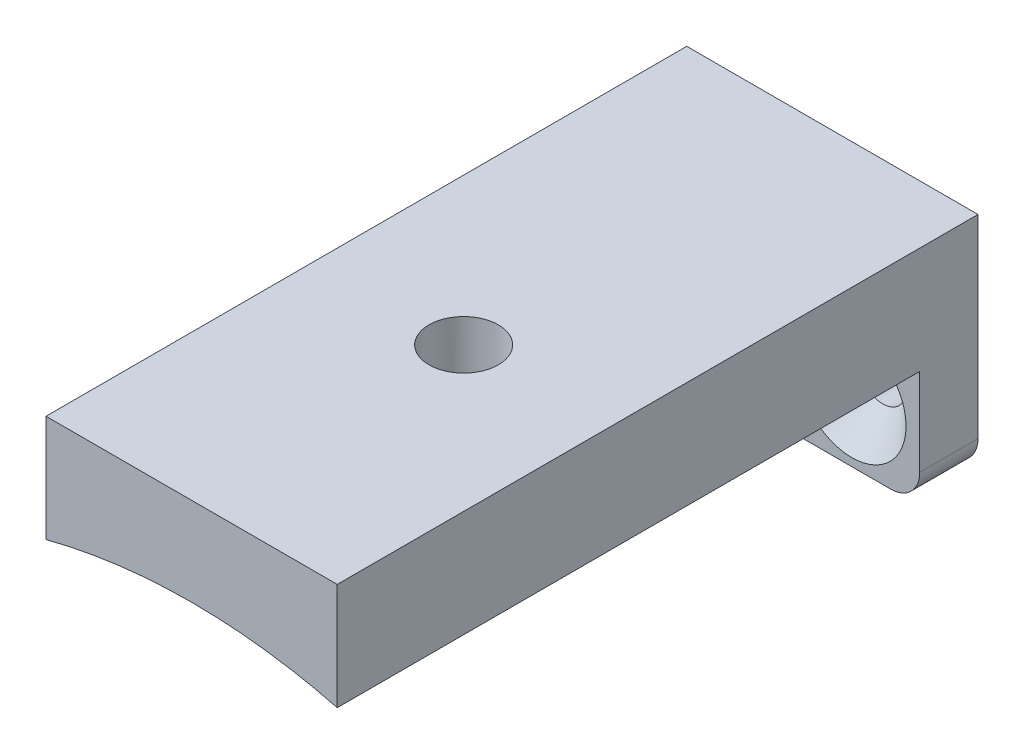
ISO-10303-21;
HEADER;
FILE_DESCRIPTION(('STEP AP214'),'2;1');
FILE_NAME('part.step','',(''),(''),'','','');
FILE_SCHEMA(('AUTOMOTIVE_DESIGN { 1 0 10303 214 1 1 1 1 }'));
ENDSEC;
DATA;
#1=APPLICATION_CONTEXT('core data for automotive mechanical design processes');
#2=APPLICATION_PROTOCOL_DEFINITION('international standard','automotive_design',2000,#1);
#3=PRODUCT_CONTEXT('',#1,'mechanical');
#4=PRODUCT('Part','Part','',(#3));
#5=PRODUCT_RELATED_PRODUCT_CATEGORY('part','',(#4));
#6=PRODUCT_DEFINITION_FORMATION('','',#4);
#7=PRODUCT_DEFINITION_CONTEXT('part definition',#1,'design');
#8=PRODUCT_DEFINITION('design','',#6,#7);
#9=PRODUCT_DEFINITION_SHAPE('','',#8);
#10=(LENGTH_UNIT() NAMED_UNIT(*) SI_UNIT(.MILLI.,.METRE.));
#11=(NAMED_UNIT(*) PLANE_ANGLE_UNIT() SI_UNIT($,.RADIAN.));
#12=(NAMED_UNIT(*) SI_UNIT($,.STERADIAN.) SOLID_ANGLE_UNIT());
#13=UNCERTAINTY_MEASURE_WITH_UNIT(LENGTH_MEASURE(1.E-05),#10,'distance_accuracy_value','');
#14=(GEOMETRIC_REPRESENTATION_CONTEXT(3) GLOBAL_UNCERTAINTY_ASSIGNED_CONTEXT((#13)) GLOBAL_UNIT_ASSIGNED_CONTEXT((#10,
#11,#12)) REPRESENTATION_CONTEXT('',''));
#15=CARTESIAN_POINT('',(0.,0.,0.));
#16=DIRECTION('',(0.,0.,1.));
#17=DIRECTION('',(1.,0.,0.));
#18=AXIS2_PLACEMENT_3D('',#15,#16,#17);
#19=CARTESIAN_POINT('',(-15.,12.,6.));
#20=DIRECTION('',(1.,0.,0.));
#21=DIRECTION('',(0.,0.,-1.));
#22=AXIS2_PLACEMENT_3D('',#19,#20,#21);
#23=PLANE('',#22);
#24=DIRECTION('',(0.,-1.,0.));
#25=VECTOR('',#24,1.);
#26=CARTESIAN_POINT('',(-15.,12.,0.));
#27=LINE('',#26,#25);
#28=CARTESIAN_POINT('',(-15.,23.,0.));
#29=VERTEX_POINT('',#28);
#30=CARTESIAN_POINT('',(-15.,3.00000000000002,0.));
#31=VERTEX_POINT('',#30);
#32=EDGE_CURVE('E127',#29,#31,#27,.T.);
#33=ORIENTED_EDGE('',*,*,#32,.T.);
#34=DIRECTION('',(0.,0.,-1.));
#35=VECTOR('',#34,1.);
#36=CARTESIAN_POINT('',(-15.,3.00000000000002,6.));
#37=LINE('',#36,#35);
#38=CARTESIAN_POINT('',(-15.,3.00000000000002,6.));
#39=VERTEX_POINT('',#38);
#40=EDGE_CURVE('E11',#39,#31,#37,.T.);
#41=ORIENTED_EDGE('',*,*,#40,.F.);
#42=DIRECTION('',(0.,-1.,0.));
#43=VECTOR('',#42,1.);
#44=CARTESIAN_POINT('',(-15.,12.,6.));
#45=LINE('',#44,#43);
#46=CARTESIAN_POINT('',(-15.,12.,6.));
#47=VERTEX_POINT('',#46);
#48=EDGE_CURVE('E97',#47,#39,#45,.T.);
#49=ORIENTED_EDGE('',*,*,#48,.F.);
#50=DIRECTION('',(0.,0.,1.));
#51=VECTOR('',#50,1.);
#52=CARTESIAN_POINT('',(-15.,12.,0.));
#53=LINE('',#52,#51);
#54=CARTESIAN_POINT('',(-15.,12.,66.));
#55=VERTEX_POINT('',#54);
#56=EDGE_CURVE('E176',#47,#55,#53,.T.);
#57=ORIENTED_EDGE('',*,*,#56,.T.);
#58=DIRECTION('',(0.,1.,0.));
#59=VECTOR('',#58,1.);
#60=CARTESIAN_POINT('',(-15.,12.,66.));
#61=LINE('',#60,#59);
#62=CARTESIAN_POINT('',(-15.,23.,66.));
#63=VERTEX_POINT('',#62);
#64=EDGE_CURVE('E178',#55,#63,#61,.T.);
#65=ORIENTED_EDGE('',*,*,#64,.T.);
#66=DIRECTION('',(0.,0.,1.));
#67=VECTOR('',#66,1.);
#68=CARTESIAN_POINT('',(-15.,23.,0.));
#69=LINE('',#68,#67);
#70=EDGE_CURVE('E183',#29,#63,#69,.T.);
#71=ORIENTED_EDGE('',*,*,#70,.F.);
#72=EDGE_LOOP('',(#33,#41,#49,#57,#65,#71));
#73=FACE_BOUND('',#72,.T.);
#74=ADVANCED_FACE('F45',(#73),#23,.F.);
#75=CARTESIAN_POINT('',(-12.,3.,6.));
#76=DIRECTION('',(0.,0.,-1.));
#77=DIRECTION('',(-1.,0.,0.));
#78=AXIS2_PLACEMENT_3D('',#75,#76,#77);
#79=CYLINDRICAL_SURFACE('',#78,3.);
#80=CARTESIAN_POINT('',(-12.,3.,0.));
#81=DIRECTION('',(0.,0.,1.));
#82=DIRECTION('',(1.,0.,0.));
#83=AXIS2_PLACEMENT_3D('',#80,#81,#82);
#84=CIRCLE('',#83,3.);
#85=CARTESIAN_POINT('',(-12.,0.,0.));
#86=VERTEX_POINT('',#85);
#87=EDGE_CURVE('E130',#31,#86,#84,.T.);
#88=ORIENTED_EDGE('',*,*,#87,.T.);
#89=DIRECTION('',(0.,0.,-1.));
#90=VECTOR('',#89,1.);
#91=CARTESIAN_POINT('',(-12.,0.,6.));
#92=LINE('',#91,#90);
#93=CARTESIAN_POINT('',(-12.,0.,6.));
#94=VERTEX_POINT('',#93);
#95=EDGE_CURVE('E55',#94,#86,#92,.T.);
#96=ORIENTED_EDGE('',*,*,#95,.F.);
#97=CARTESIAN_POINT('',(-12.,3.,6.));
#98=DIRECTION('',(0.,0.,1.));
#99=DIRECTION('',(1.,0.,0.));
#100=AXIS2_PLACEMENT_3D('',#97,#98,#99);
#101=CIRCLE('',#100,3.);
#102=EDGE_CURVE('E111',#39,#94,#101,.T.);
#103=ORIENTED_EDGE('',*,*,#102,.F.);
#104=ORIENTED_EDGE('',*,*,#40,.T.);
#105=EDGE_LOOP('',(#88,#96,#103,#104));
#106=FACE_BOUND('',#105,.T.);
#107=ADVANCED_FACE('F249',(#106),#79,.T.);
#108=CARTESIAN_POINT('',(-12.,0.,6.));
#109=DIRECTION('',(0.,1.,0.));
#110=DIRECTION('',(0.,0.,1.));
#111=AXIS2_PLACEMENT_3D('',#108,#109,#110);
#112=PLANE('',#111);
#113=DIRECTION('',(1.,0.,0.));
#114=VECTOR('',#113,1.);
#115=CARTESIAN_POINT('',(-12.,0.,0.));
#116=LINE('',#115,#114);
#117=CARTESIAN_POINT('',(12.,0.,0.));
#118=VERTEX_POINT('',#117);
#119=EDGE_CURVE('E81',#86,#118,#116,.T.);
#120=ORIENTED_EDGE('',*,*,#119,.T.);
#121=DIRECTION('',(0.,0.,-1.));
#122=VECTOR('',#121,1.);
#123=CARTESIAN_POINT('',(12.,0.,6.));
#124=LINE('',#123,#122);
#125=CARTESIAN_POINT('',(12.,0.,6.));
#126=VERTEX_POINT('',#125);
#127=EDGE_CURVE('E115',#126,#118,#124,.T.);
#128=ORIENTED_EDGE('',*,*,#127,.F.);
#129=DIRECTION('',(1.,0.,0.));
#130=VECTOR('',#129,1.);
#131=CARTESIAN_POINT('',(-12.,0.,6.));
#132=LINE('',#131,#130);
#133=EDGE_CURVE('E106',#94,#126,#132,.T.);
#134=ORIENTED_EDGE('',*,*,#133,.F.);
#135=ORIENTED_EDGE('',*,*,#95,.T.);
#136=EDGE_LOOP('',(#120,#128,#134,#135));
#137=FACE_BOUND('',#136,.T.);
#138=ADVANCED_FACE('F116',(#137),#112,.F.);
#139=CARTESIAN_POINT('',(12.,3.,6.));
#140=DIRECTION('',(0.,0.,-1.));
#141=DIRECTION('',(-1.,0.,0.));
#142=AXIS2_PLACEMENT_3D('',#139,#140,#141);
#143=CYLINDRICAL_SURFACE('',#142,3.);
#144=CARTESIAN_POINT('',(12.,3.,0.));
#145=DIRECTION('',(0.,0.,1.));
#146=DIRECTION('',(1.,0.,0.));
#147=AXIS2_PLACEMENT_3D('',#144,#145,#146);
#148=CIRCLE('',#147,3.);
#149=CARTESIAN_POINT('',(15.,3.,0.));
#150=VERTEX_POINT('',#149);
#151=EDGE_CURVE('E88',#118,#150,#148,.T.);
#152=ORIENTED_EDGE('',*,*,#151,.T.);
#153=DIRECTION('',(0.,0.,-1.));
#154=VECTOR('',#153,1.);
#155=CARTESIAN_POINT('',(15.,3.,6.));
#156=LINE('',#155,#154);
#157=CARTESIAN_POINT('',(15.,3.,6.));
#158=VERTEX_POINT('',#157);
#159=EDGE_CURVE('E118',#158,#150,#156,.T.);
#160=ORIENTED_EDGE('',*,*,#159,.F.);
#161=CARTESIAN_POINT('',(12.,3.,6.));
#162=DIRECTION('',(0.,0.,1.));
#163=DIRECTION('',(1.,0.,0.));
#164=AXIS2_PLACEMENT_3D('',#161,#162,#163);
#165=CIRCLE('',#164,3.);
#166=EDGE_CURVE('E109',#126,#158,#165,.T.);
#167=ORIENTED_EDGE('',*,*,#166,.F.);
#168=ORIENTED_EDGE('',*,*,#127,.T.);
#169=EDGE_LOOP('',(#152,#160,#167,#168));
#170=FACE_BOUND('',#169,.T.);
#171=ADVANCED_FACE('F120',(#170),#143,.T.);
#172=CARTESIAN_POINT('',(15.,3.00000000000002,6.));
#173=DIRECTION('',(-1.,0.,0.));
#174=DIRECTION('',(0.,0.,1.));
#175=AXIS2_PLACEMENT_3D('',#172,#173,#174);
#176=PLANE('',#175);
#177=DIRECTION('',(0.,1.,0.));
#178=VECTOR('',#177,1.);
#179=CARTESIAN_POINT('',(15.,3.00000000000002,0.));
#180=LINE('',#179,#178);
#181=CARTESIAN_POINT('',(15.,23.,0.));
#182=VERTEX_POINT('',#181);
#183=EDGE_CURVE('E138',#150,#182,#180,.T.);
#184=ORIENTED_EDGE('',*,*,#183,.T.);
#185=DIRECTION('',(0.,0.,1.));
#186=VECTOR('',#185,1.);
#187=CARTESIAN_POINT('',(15.,23.,0.));
#188=LINE('',#187,#186);
#189=CARTESIAN_POINT('',(15.,23.,66.));
#190=VERTEX_POINT('',#189);
#191=EDGE_CURVE('E161',#182,#190,#188,.T.);
#192=ORIENTED_EDGE('',*,*,#191,.T.);
#193=DIRECTION('',(0.,-1.,0.));
#194=VECTOR('',#193,1.);
#195=CARTESIAN_POINT('',(15.,23.,66.));
#196=LINE('',#195,#194);
#197=CARTESIAN_POINT('',(15.,12.,66.));
#198=VERTEX_POINT('',#197);
#199=EDGE_CURVE('E212',#190,#198,#196,.T.);
#200=ORIENTED_EDGE('',*,*,#199,.T.);
#201=DIRECTION('',(0.,0.,1.));
#202=VECTOR('',#201,1.);
#203=CARTESIAN_POINT('',(15.,12.,0.));
#204=LINE('',#203,#202);
#205=CARTESIAN_POINT('',(15.,12.,6.));
#206=VERTEX_POINT('',#205);
#207=EDGE_CURVE('E196',#206,#198,#204,.T.);
#208=ORIENTED_EDGE('',*,*,#207,.F.);
#209=DIRECTION('',(0.,1.,0.));
#210=VECTOR('',#209,1.);
#211=CARTESIAN_POINT('',(15.,3.00000000000002,6.));
#212=LINE('',#211,#210);
#213=EDGE_CURVE('E63',#158,#206,#212,.T.);
#214=ORIENTED_EDGE('',*,*,#213,.F.);
#215=ORIENTED_EDGE('',*,*,#159,.T.);
#216=EDGE_LOOP('',(#184,#192,#200,#208,#214,#215));
#217=FACE_BOUND('',#216,.T.);
#218=ADVANCED_FACE('F158',(#217),#176,.F.);
#219=CARTESIAN_POINT('',(0.,-46.0947501931112,6.));
#220=DIRECTION('',(0.,0.,-1.));
#221=DIRECTION('',(-1.,0.,0.));
#222=AXIS2_PLACEMENT_3D('',#219,#220,#221);
#223=PLANE('',#222);
#224=CARTESIAN_POINT('',(-8.,6.4,6.));
#225=DIRECTION('',(0.,0.,1.));
#226=DIRECTION('',(1.,0.,0.));
#227=AXIS2_PLACEMENT_3D('',#224,#225,#226);
#228=CIRCLE('',#227,5.59);
#229=CARTESIAN_POINT('',(-2.41,6.4,6.));
#230=VERTEX_POINT('',#229);
#231=EDGE_CURVE('E182',#230,#230,#228,.T.);
#232=ORIENTED_EDGE('',*,*,#231,.F.);
#233=EDGE_LOOP('',(#232));
#234=FACE_BOUND('',#233,.T.);
#235=CARTESIAN_POINT('',(8.,6.4,6.));
#236=DIRECTION('',(0.,0.,1.));
#237=DIRECTION('',(1.,0.,0.));
#238=AXIS2_PLACEMENT_3D('',#235,#236,#237);
#239=CIRCLE('',#238,5.59);
#240=CARTESIAN_POINT('',(13.59,6.4,6.));
#241=VERTEX_POINT('',#240);
#242=EDGE_CURVE('E234',#241,#241,#239,.T.);
#243=ORIENTED_EDGE('',*,*,#242,.F.);
#244=EDGE_LOOP('',(#243));
#245=FACE_BOUND('',#244,.T.);
#246=CARTESIAN_POINT('',(0.,-46.0947501931112,6.));
#247=DIRECTION('',(0.,0.,1.));
#248=DIRECTION('',(-1.,0.,0.));
#249=AXIS2_PLACEMENT_3D('',#246,#247,#248);
#250=CIRCLE('',#249,60.);
#251=EDGE_CURVE('E142',#206,#47,#250,.T.);
#252=ORIENTED_EDGE('',*,*,#251,.T.);
#253=ORIENTED_EDGE('',*,*,#48,.T.);
#254=ORIENTED_EDGE('',*,*,#102,.T.);
#255=ORIENTED_EDGE('',*,*,#133,.T.);
#256=ORIENTED_EDGE('',*,*,#166,.T.);
#257=ORIENTED_EDGE('',*,*,#213,.T.);
#258=EDGE_LOOP('',(#252,#253,#254,#255,#256,#257));
#259=FACE_BOUND('',#258,.T.);
#260=ADVANCED_FACE('F107',(#234,#245,#259),#223,.F.);
#261=CARTESIAN_POINT('',(0.,-46.0947501931112,0.));
#262=DIRECTION('',(0.,0.,-1.));
#263=DIRECTION('',(-1.,0.,0.));
#264=AXIS2_PLACEMENT_3D('',#261,#262,#263);
#265=PLANE('',#264);
#266=CARTESIAN_POINT('',(-8.,6.4,0.));
#267=DIRECTION('',(0.,0.,1.));
#268=DIRECTION('',(1.,0.,0.));
#269=AXIS2_PLACEMENT_3D('',#266,#267,#268);
#270=CIRCLE('',#269,2.4);
#271=CARTESIAN_POINT('',(-5.6,6.4,0.));
#272=VERTEX_POINT('',#271);
#273=EDGE_CURVE('E230',#272,#272,#270,.T.);
#274=ORIENTED_EDGE('',*,*,#273,.T.);
#275=EDGE_LOOP('',(#274));
#276=FACE_BOUND('',#275,.T.);
#277=CARTESIAN_POINT('',(8.,6.4,0.));
#278=DIRECTION('',(0.,0.,1.));
#279=DIRECTION('',(1.,0.,0.));
#280=AXIS2_PLACEMENT_3D('',#277,#278,#279);
#281=CIRCLE('',#280,2.4);
#282=CARTESIAN_POINT('',(10.4,6.4,0.));
#283=VERTEX_POINT('',#282);
#284=EDGE_CURVE('E131',#283,#283,#281,.T.);
#285=ORIENTED_EDGE('',*,*,#284,.T.);
#286=EDGE_LOOP('',(#285));
#287=FACE_BOUND('',#286,.T.);
#288=ORIENTED_EDGE('',*,*,#32,.F.);
#289=DIRECTION('',(1.,0.,0.));
#290=VECTOR('',#289,1.);
#291=CARTESIAN_POINT('',(-15.,23.,0.));
#292=LINE('',#291,#290);
#293=EDGE_CURVE('E154',#29,#182,#292,.T.);
#294=ORIENTED_EDGE('',*,*,#293,.T.);
#295=ORIENTED_EDGE('',*,*,#183,.F.);
#296=ORIENTED_EDGE('',*,*,#151,.F.);
#297=ORIENTED_EDGE('',*,*,#119,.F.);
#298=ORIENTED_EDGE('',*,*,#87,.F.);
#299=EDGE_LOOP('',(#288,#294,#295,#296,#297,#298));
#300=FACE_BOUND('',#299,.T.);
#301=ADVANCED_FACE('F150',(#276,#287,#300),#265,.T.);
#302=CARTESIAN_POINT('',(8.,6.4,6.));
#303=DIRECTION('',(0.,0.,1.));
#304=DIRECTION('',(1.,0.,0.));
#305=AXIS2_PLACEMENT_3D('',#302,#303,#304);
#306=CYLINDRICAL_SURFACE('',#305,2.4);
#307=ORIENTED_EDGE('',*,*,#284,.F.);
#308=EDGE_LOOP('',(#307));
#309=FACE_BOUND('',#308,.T.);
#310=CARTESIAN_POINT('',(8.,6.4,2.81));
#311=DIRECTION('',(0.,0.,1.));
#312=DIRECTION('',(1.,0.,0.));
#313=AXIS2_PLACEMENT_3D('',#310,#311,#312);
#314=CIRCLE('',#313,2.4);
#315=CARTESIAN_POINT('',(10.4,6.4,2.81));
#316=VERTEX_POINT('',#315);
#317=EDGE_CURVE('E238',#316,#316,#314,.T.);
#318=ORIENTED_EDGE('',*,*,#317,.T.);
#319=EDGE_LOOP('',(#318));
#320=FACE_BOUND('',#319,.T.);
#321=ADVANCED_FACE('F263',(#309,#320),#306,.F.);
#322=CARTESIAN_POINT('',(8.,6.4,6.));
#323=DIRECTION('',(0.,0.,1.));
#324=DIRECTION('',(1.,0.,0.));
#325=AXIS2_PLACEMENT_3D('',#322,#323,#324);
#326=CONICAL_SURFACE('',#325,5.59,0.785398163397449);
#327=ORIENTED_EDGE('',*,*,#317,.F.);
#328=EDGE_LOOP('',(#327));
#329=FACE_BOUND('',#328,.T.);
#330=ORIENTED_EDGE('',*,*,#242,.T.);
#331=EDGE_LOOP('',(#330));
#332=FACE_BOUND('',#331,.T.);
#333=ADVANCED_FACE('F270',(#329,#332),#326,.F.);
#334=CARTESIAN_POINT('',(-8.,6.4,6.));
#335=DIRECTION('',(0.,0.,1.));
#336=DIRECTION('',(1.,0.,0.));
#337=AXIS2_PLACEMENT_3D('',#334,#335,#336);
#338=CYLINDRICAL_SURFACE('',#337,2.4);
#339=ORIENTED_EDGE('',*,*,#273,.F.);
#340=EDGE_LOOP('',(#339));
#341=FACE_BOUND('',#340,.T.);
#342=CARTESIAN_POINT('',(-8.,6.4,2.81));
#343=DIRECTION('',(0.,0.,1.));
#344=DIRECTION('',(1.,0.,0.));
#345=AXIS2_PLACEMENT_3D('',#342,#343,#344);
#346=CIRCLE('',#345,2.4);
#347=CARTESIAN_POINT('',(-5.6,6.4,2.81));
#348=VERTEX_POINT('',#347);
#349=EDGE_CURVE('E226',#348,#348,#346,.T.);
#350=ORIENTED_EDGE('',*,*,#349,.T.);
#351=EDGE_LOOP('',(#350));
#352=FACE_BOUND('',#351,.T.);
#353=ADVANCED_FACE('F274',(#341,#352),#338,.F.);
#354=CARTESIAN_POINT('',(-8.,6.4,6.));
#355=DIRECTION('',(0.,0.,1.));
#356=DIRECTION('',(1.,0.,0.));
#357=AXIS2_PLACEMENT_3D('',#354,#355,#356);
#358=CONICAL_SURFACE('',#357,5.59,0.785398163397449);
#359=ORIENTED_EDGE('',*,*,#349,.F.);
#360=EDGE_LOOP('',(#359));
#361=FACE_BOUND('',#360,.T.);
#362=ORIENTED_EDGE('',*,*,#231,.T.);
#363=EDGE_LOOP('',(#362));
#364=FACE_BOUND('',#363,.T.);
#365=ADVANCED_FACE('F278',(#361,#364),#358,.F.);
#366=CARTESIAN_POINT('',(0.,-46.0947501931112,0.));
#367=DIRECTION('',(0.,0.,1.));
#368=DIRECTION('',(1.,0.,0.));
#369=AXIS2_PLACEMENT_3D('',#366,#367,#368);
#370=CYLINDRICAL_SURFACE('',#369,60.);
#371=CARTESIAN_POINT('',(0.121475485369321,13.9051268376499,44.0730291017226));
#372=CARTESIAN_POINT('',(0.288306900275761,13.9047895121054,44.073030735129));
#373=CARTESIAN_POINT('',(0.455111942733274,13.903754130058,44.0660142029317));
#374=CARTESIAN_POINT('',(0.78758314014404,13.9003107650474,44.0380001098651));
#375=CARTESIAN_POINT('',(0.95324901188909,13.8979024524189,44.0169991908888));
#376=CARTESIAN_POINT('',(1.28233626942047,13.8917710146109,43.961142553556));
#377=CARTESIAN_POINT('',(1.445755754375,13.8880468395318,43.9262757691138));
#378=CARTESIAN_POINT('',(1.76911659791562,13.8793808599646,43.8429274928021));
#379=CARTESIAN_POINT('',(1.92905666051269,13.8744386099502,43.7944410184514));
#380=CARTESIAN_POINT('',(2.24410841660304,13.8634752728599,43.684264520182));
#381=CARTESIAN_POINT('',(2.39922466093211,13.8574552411962,43.6225874017401));
#382=CARTESIAN_POINT('',(2.70375602483526,13.8444935594458,43.4864203936285));
#383=CARTESIAN_POINT('',(2.8531690203965,13.8375515702314,43.411925786251));
#384=CARTESIAN_POINT('',(3.14510134532214,13.8229407537132,43.250717981695));
#385=CARTESIAN_POINT('',(3.28762457674367,13.8152723452809,43.1640118121364));
#386=CARTESIAN_POINT('',(3.56492524551969,13.7994115065266,42.9789284617578));
#387=CARTESIAN_POINT('',(3.69969979386538,13.7912188831318,42.8805469692805));
#388=CARTESIAN_POINT('',(3.96086975898068,13.7745130767939,42.6725415912132));
#389=CARTESIAN_POINT('',(4.08724079739188,13.7659990647226,42.562887161983));
#390=CARTESIAN_POINT('',(4.33035071168885,13.7489037813208,42.3332940177267));
#391=CARTESIAN_POINT('',(4.44708600997719,13.7403224862925,42.2133515163062));
#392=CARTESIAN_POINT('',(4.67001633119433,13.723336070395,41.9640995921718));
#393=CARTESIAN_POINT('',(4.77621473664646,13.7149308936767,41.8347931986366));
#394=CARTESIAN_POINT('',(4.97740255890584,13.6985241587444,41.5676369552356));
#395=CARTESIAN_POINT('',(5.0723878250426,13.6905227506134,41.4297839703709));
#396=CARTESIAN_POINT('',(5.25058380693164,13.6751367548445,41.1462999188646));
#397=CARTESIAN_POINT('',(5.33377393087703,13.6677532549283,41.0006558463972));
#398=CARTESIAN_POINT('',(5.48761665469883,13.6538232755866,40.7027861632779));
#399=CARTESIAN_POINT('',(5.55826459941638,13.6472771071962,40.550558134885));
#400=CARTESIAN_POINT('',(5.68644976219548,13.6352125253937,40.2406956303324));
#401=CARTESIAN_POINT('',(5.74399206797766,13.6296937133056,40.0830632796131));
#402=CARTESIAN_POINT('',(5.84559890608043,13.6198337809266,39.7634601457816));
#403=CARTESIAN_POINT('',(5.88965847570412,13.615493094344,39.6014877890089));
#404=CARTESIAN_POINT('',(6.00077585282751,13.6044670495213,39.1119875951088));
#405=CARTESIAN_POINT('',(6.04734051731879,13.5997224217353,38.7794988892712));
#406=CARTESIAN_POINT('',(6.08401762482422,13.5959946598984,38.111574783169));
#407=CARTESIAN_POINT('',(6.07413153027151,13.597011376592,37.7761394594653));
#408=CARTESIAN_POINT('',(5.99841232971398,13.6046674964159,37.1128848220421));
#409=CARTESIAN_POINT('',(5.93277905273735,13.6112868163917,36.7850425968479));
#410=CARTESIAN_POINT('',(5.74771867669055,13.6293847513679,36.1450650512391));
#411=CARTESIAN_POINT('',(5.62829086098091,13.6408634311036,35.8329299401331));
#412=CARTESIAN_POINT('',(5.33881408113581,13.667429504918,35.2325793901981));
#413=CARTESIAN_POINT('',(5.16867638144221,13.6825232156503,34.9444070229803));
#414=CARTESIAN_POINT('',(4.7826692658537,13.7146425440546,34.4006377190223));
#415=CARTESIAN_POINT('',(4.56679853213248,13.7316682173908,34.1450417213308));
#416=CARTESIAN_POINT('',(4.09433398788524,13.7658598638235,33.6725176612298));
#417=CARTESIAN_POINT('',(3.83756750894408,13.7830261251328,33.4557622280867));
#418=CARTESIAN_POINT('',(3.29119677064051,13.8155393378607,33.0684103485316));
#419=CARTESIAN_POINT('',(3.00159247531407,13.8308862872867,32.8978139526737));
#420=CARTESIAN_POINT('',(2.3976451929862,13.858086091901,32.6076297869871));
#421=CARTESIAN_POINT('',(2.0832979959062,13.8699383508219,32.4880507202295));
#422=CARTESIAN_POINT('',(1.4388422900319,13.8888606582581,32.3034218838545));
#423=CARTESIAN_POINT('',(1.10873424561877,13.8959308475805,32.2383705086676));
#424=CARTESIAN_POINT('',(0.443621326518974,13.9045274892035,32.164862492759));
#425=CARTESIAN_POINT('',(0.108643071619438,13.9060772647238,32.1561676231482));
#426=CARTESIAN_POINT('',(-0.558014254120361,13.9035809525234,32.1949938208709));
#427=CARTESIAN_POINT('',(-0.88969336877718,13.8995349392217,32.242514140591));
#428=CARTESIAN_POINT('',(-1.53964925192805,13.8863717153279,32.3922241391667));
#429=CARTESIAN_POINT('',(-1.85795192912682,13.8772648449609,32.4943023304454));
#430=CARTESIAN_POINT('',(-2.47292368773804,13.855057288402,32.7501159931826));
#431=CARTESIAN_POINT('',(-2.76959229100519,13.8419565139719,32.9038526059486));
#432=CARTESIAN_POINT('',(-3.33394985887827,13.8132208074907,33.2592099760361));
#433=CARTESIAN_POINT('',(-3.601539801533,13.7975776428539,33.4609873168319));
#434=CARTESIAN_POINT('',(-4.09913885745972,13.7655818506107,33.9064750174895));
#435=CARTESIAN_POINT('',(-4.32914704192761,13.7492292054826,34.1501864134135));
#436=CARTESIAN_POINT('',(-4.74587787241966,13.7176280507178,34.6736588649459));
#437=CARTESIAN_POINT('',(-4.93244420616707,13.7023836600534,34.9535446344039));
#438=CARTESIAN_POINT('',(-5.25591651205526,13.6748224651928,35.540822140685));
#439=CARTESIAN_POINT('',(-5.39282315426147,13.6625056214956,35.8482135063013));
#440=CARTESIAN_POINT('',(-5.61283202082788,13.6422430337841,36.4811771494112));
#441=CARTESIAN_POINT('',(-5.69602738818616,13.6342897263944,36.8067168839094));
#442=CARTESIAN_POINT('',(-5.80652938714439,13.6236509978222,37.4674098637868));
#443=CARTESIAN_POINT('',(-5.83383759482981,13.6209654280832,37.8025628377908));
#444=CARTESIAN_POINT('',(-5.83234970876361,13.6211063407956,38.3040948625691));
#445=CARTESIAN_POINT('',(-5.82482573066805,13.6218435746574,38.4707996576594));
#446=CARTESIAN_POINT('',(-5.7958230961838,13.6246661902143,38.8029626985622));
#447=CARTESIAN_POINT('',(-5.7743496193057,13.6267510715205,38.9684213840027));
#448=CARTESIAN_POINT('',(-5.71758819578345,13.6322117613987,39.2969805141792));
#449=CARTESIAN_POINT('',(-5.68229518521016,13.6355880431716,39.4600800717105));
#450=CARTESIAN_POINT('',(-5.59817072309587,13.6435312533253,39.7826588632557));
#451=CARTESIAN_POINT('',(-5.5493442230399,13.6480977462082,39.9421393983143));
#452=CARTESIAN_POINT('',(-5.43848720166895,13.6582911716817,40.2564478898789));
#453=CARTESIAN_POINT('',(-5.37645368518511,13.6639183447866,40.4112747818983));
#454=CARTESIAN_POINT('',(-5.23966020278743,13.6760676977511,40.7150955764722));
#455=CARTESIAN_POINT('',(-5.16490488754807,13.6825895503768,40.8640915862123));
#456=CARTESIAN_POINT('',(-5.00315578173447,13.6963446203389,41.1553198569116));
#457=CARTESIAN_POINT('',(-4.91615766967923,13.7035780885899,41.2975497057179));
#458=CARTESIAN_POINT('',(-4.73059218542496,13.7185439422384,41.5741471115805));
#459=CARTESIAN_POINT('',(-4.63202901987048,13.726276145769,41.708517500932));
#460=CARTESIAN_POINT('',(-4.42352627510007,13.7420561346928,41.9691094942609));
#461=CARTESIAN_POINT('',(-4.31353699277114,13.7501051954613,42.0952912565109));
#462=CARTESIAN_POINT('',(-4.08337352535885,13.766250138732,42.3379045639209));
#463=CARTESIAN_POINT('',(-3.96320307221024,13.774346003073,42.4543396509039));
#464=CARTESIAN_POINT('',(-3.71340995720571,13.7903585991069,42.6767611550437));
#465=CARTESIAN_POINT('',(-3.58378158894013,13.7982752188154,42.7827411719413));
#466=CARTESIAN_POINT('',(-3.31609718547567,13.8136921359907,42.983386427729));
#467=CARTESIAN_POINT('',(-3.17804427975999,13.8211925860998,43.0780558300099));
#468=CARTESIAN_POINT('',(-2.8940303193793,13.8355831909426,43.2557076172884));
#469=CARTESIAN_POINT('',(-2.74804776544073,13.8424715378544,43.3386557838434));
#470=CARTESIAN_POINT('',(-2.44962760119642,13.8554092750635,43.4919178457679));
#471=CARTESIAN_POINT('',(-2.29719238000882,13.8614589723872,43.5622363676054));
#472=CARTESIAN_POINT('',(-1.98702296650567,13.8725391687795,43.6897154555534));
#473=CARTESIAN_POINT('',(-1.82929324226848,13.8775705032372,43.7468868119069));
#474=CARTESIAN_POINT('',(-1.50959569529715,13.8864693694979,43.847714893474));
#475=CARTESIAN_POINT('',(-1.34762892528857,13.8903371874556,43.8913749417275));
#476=CARTESIAN_POINT('',(-0.970091185484359,13.8977881984495,43.9762178879562));
#477=CARTESIAN_POINT('',(-0.753388776122357,13.9009160113465,44.0124872582019));
#478=CARTESIAN_POINT('',(-0.317283877795166,13.9048070909938,44.0608917424323));
#479=CARTESIAN_POINT('',(-0.0978813997567413,13.9055703673097,44.0730269540519));
#480=CARTESIAN_POINT('',(0.121475485369321,13.9051268376499,44.0730291017226));
#481=B_SPLINE_CURVE_WITH_KNOTS('',3,(#371,#372,#373,#374,#375,#376,#377,#378,#379,#380,#381,
#382,#383,#384,#385,#386,#387,#388,#389,#390,#391,#392,#393,#394,#395,#396,#397,#398,#399,#400,
#401,#402,#403,#404,#405,#406,#407,#408,#409,#410,#411,#412,#413,#414,#415,#416,#417,#418,#419,
#420,#421,#422,#423,#424,#425,#426,#427,#428,#429,#430,#431,#432,#433,#434,#435,#436,#437,#438,
#439,#440,#441,#442,#443,#444,#445,#446,#447,#448,#449,#450,#451,#452,#453,#454,#455,#456,#457,
#458,#459,#460,#461,#462,#463,#464,#465,#466,#467,#468,#469,#470,#471,#472,#473,#474,#475,#476,
#477,#478,#479,#480),.UNSPECIFIED.,.T.,.F.,(4,2,2,2,2,2,2,2,2,2,2,2,2,2,2,2,2,2,2,2,2,2,2,2,2,2,
2,2,2,2,2,2,2,2,2,2,2,2,2,2,2,2,2,2,2,2,2,2,2,2,2,2,2,2,4),(0.,0.500303447203701,
1.00072707691335,1.50155088936283,2.00255815697431,2.50307747283588,3.00378140949468,
3.50419836511004,4.00480070149035,4.50679705829758,5.00897896778959,5.51099914311922,
6.01320456805569,6.51627621713455,7.01953419782648,7.5225964752103,8.02584369658281,
9.02792100747607,10.0299723583215,11.0284468831348,12.0269347098082,13.0271801192354,
14.0274543552887,15.0320696866883,16.0366861183549,17.0414738595682,18.046232013736,
19.046740092545,20.0472348656117,21.0456929271862,22.0441730494894,23.0459532688662,
24.0477582427235,25.0531140470071,26.0584562853741,27.0620504006604,28.0656162129893,
28.5657580007566,29.0657141897286,29.5658537507002,30.0658105670743,30.565880887755,
31.0657687902071,31.5658335885201,32.065717055066,32.5678740819676,33.0698478317325,
33.572126991337,34.0742206906717,34.5777511669378,35.0810968129732,35.584027863056,
36.0868351212283,36.7446575693267,37.4024773561935),.UNSPECIFIED.);
#482=CARTESIAN_POINT('',(0.121475485369321,13.9051268376499,44.0730291017226));
#483=VERTEX_POINT('',#482);
#484=EDGE_CURVE('E198',#483,#483,#481,.T.);
#485=ORIENTED_EDGE('',*,*,#484,.T.);
#486=EDGE_LOOP('',(#485));
#487=FACE_BOUND('',#486,.T.);
#488=ORIENTED_EDGE('',*,*,#56,.F.);
#489=ORIENTED_EDGE('',*,*,#251,.F.);
#490=ORIENTED_EDGE('',*,*,#207,.T.);
#491=CARTESIAN_POINT('',(0.,-46.0947501931112,66.));
#492=DIRECTION('',(0.,0.,1.));
#493=DIRECTION('',(1.,0.,0.));
#494=AXIS2_PLACEMENT_3D('',#491,#492,#493);
#495=CIRCLE('',#494,60.);
#496=EDGE_CURVE('E190',#198,#55,#495,.T.);
#497=ORIENTED_EDGE('',*,*,#496,.T.);
#498=EDGE_LOOP('',(#488,#489,#490,#497));
#499=FACE_BOUND('',#498,.T.);
#500=ADVANCED_FACE('F194',(#487,#499),#370,.F.);
#501=CARTESIAN_POINT('',(-15.,23.,0.));
#502=DIRECTION('',(0.,-1.,0.));
#503=DIRECTION('',(0.,0.,-1.));
#504=AXIS2_PLACEMENT_3D('',#501,#502,#503);
#505=PLANE('',#504);
#506=CARTESIAN_POINT('',(0.139888925303575,23.,38.1192691017226));
#507=DIRECTION('',(0.,-1.,0.));
#508=DIRECTION('',(-1.,0.,0.));
#509=AXIS2_PLACEMENT_3D('',#506,#507,#508);
#510=ELLIPSE('',#509,3.57124731922608,3.57124);
#511=CARTESIAN_POINT('',(-3.4313583939225,23.,38.1192691017226));
#512=VERTEX_POINT('',#511);
#513=EDGE_CURVE('E48',#512,#512,#510,.T.);
#514=ORIENTED_EDGE('',*,*,#513,.T.);
#515=EDGE_LOOP('',(#514));
#516=FACE_BOUND('',#515,.T.);
#517=ORIENTED_EDGE('',*,*,#70,.T.);
#518=DIRECTION('',(1.,0.,0.));
#519=VECTOR('',#518,1.);
#520=CARTESIAN_POINT('',(-15.,23.,66.));
#521=LINE('',#520,#519);
#522=EDGE_CURVE('E191',#63,#190,#521,.T.);
#523=ORIENTED_EDGE('',*,*,#522,.T.);
#524=ORIENTED_EDGE('',*,*,#191,.F.);
#525=ORIENTED_EDGE('',*,*,#293,.F.);
#526=EDGE_LOOP('',(#517,#523,#524,#525));
#527=FACE_BOUND('',#526,.T.);
#528=ADVANCED_FACE('F285',(#516,#527),#505,.F.);
#529=CARTESIAN_POINT('',(0.,-46.0947501931112,66.));
#530=DIRECTION('',(0.,0.,1.));
#531=DIRECTION('',(1.,0.,0.));
#532=AXIS2_PLACEMENT_3D('',#529,#530,#531);
#533=PLANE('',#532);
#534=ORIENTED_EDGE('',*,*,#496,.F.);
#535=ORIENTED_EDGE('',*,*,#199,.F.);
#536=ORIENTED_EDGE('',*,*,#522,.F.);
#537=ORIENTED_EDGE('',*,*,#64,.F.);
#538=EDGE_LOOP('',(#534,#535,#536,#537));
#539=FACE_BOUND('',#538,.T.);
#540=ADVANCED_FACE('F188',(#539),#533,.T.);
#541=CARTESIAN_POINT('',(0.121475485369315,13.9051268376499,38.1192691017226));
#542=DIRECTION('',(-0.00202459142282203,-0.999997950512685,0.));
#543=DIRECTION('',(0.999997950512685,-0.00202459142282203,0.));
#544=AXIS2_PLACEMENT_3D('',#541,#542,#543);
#545=CYLINDRICAL_SURFACE('',#544,5.95376);
#546=ORIENTED_EDGE('',*,*,#484,.F.);
#547=EDGE_LOOP('',(#546));
#548=FACE_BOUND('',#547,.T.);
#549=CARTESIAN_POINT('',(0.12248778111312,14.4051258289062,38.1192691017226));
#550=DIRECTION('',(-0.00202459142282203,-0.999997950512685,0.));
#551=DIRECTION('',(0.999997950512685,-0.00202459142282203,0.));
#552=AXIS2_PLACEMENT_3D('',#549,#550,#551);
#553=CIRCLE('',#552,5.95376);
#554=CARTESIAN_POINT('',(6.07623557895753,14.3930718974766,38.1192691017226));
#555=VERTEX_POINT('',#554);
#556=EDGE_CURVE('E312',#555,#555,#553,.T.);
#557=ORIENTED_EDGE('',*,*,#556,.F.);
#558=EDGE_LOOP('',(#557));
#559=FACE_BOUND('',#558,.T.);
#560=ADVANCED_FACE('F291',(#548,#559),#545,.F.);
#561=CARTESIAN_POINT('',(0.121475485369315,13.9051268376499,38.1192691017226));
#562=DIRECTION('',(-0.00202459142282203,-0.999997950512685,0.));
#563=DIRECTION('',(0.999997950512685,-0.00202459142282203,0.));
#564=AXIS2_PLACEMENT_3D('',#561,#562,#563);
#565=CYLINDRICAL_SURFACE('',#564,3.57124);
#566=CARTESIAN_POINT('',(0.12248778111312,14.4051258289062,38.1192691017226));
#567=DIRECTION('',(-0.00202459142282203,-0.999997950512685,0.));
#568=DIRECTION('',(0.999997950512685,-0.00202459142282203,0.));
#569=AXIS2_PLACEMENT_3D('',#566,#567,#568);
#570=CIRCLE('',#569,3.57124);
#571=CARTESIAN_POINT('',(3.69372046190205,14.3978955270333,38.1192691017226));
#572=VERTEX_POINT('',#571);
#573=EDGE_CURVE('E309',#572,#572,#570,.T.);
#574=ORIENTED_EDGE('',*,*,#573,.T.);
#575=EDGE_LOOP('',(#574));
#576=FACE_BOUND('',#575,.T.);
#577=ORIENTED_EDGE('',*,*,#513,.F.);
#578=EDGE_LOOP('',(#577));
#579=FACE_BOUND('',#578,.T.);
#580=ADVANCED_FACE('F296',(#576,#579),#565,.F.);
#581=CARTESIAN_POINT('',(0.12248778111312,14.4051258289062,41.6905091017226));
#582=DIRECTION('',(0.00202459142282203,0.999997950512685,0.));
#583=DIRECTION('',(-0.999997950512685,0.00202459142282203,0.));
#584=AXIS2_PLACEMENT_3D('',#581,#582,#583);
#585=PLANE('',#584);
#586=ORIENTED_EDGE('',*,*,#573,.F.);
#587=EDGE_LOOP('',(#586));
#588=FACE_BOUND('',#587,.T.);
#589=ORIENTED_EDGE('',*,*,#556,.T.);
#590=EDGE_LOOP('',(#589));
#591=FACE_BOUND('',#590,.T.);
#592=ADVANCED_FACE('F300',(#588,#591),#585,.F.);
#593=CLOSED_SHELL('',(#74,#107,#138,#171,#218,#260,#301,#321,#333,#353,#365,#500,#528,#540,#560,
#580,#592));
#594=MANIFOLD_SOLID_BREP('B2',#593);
#595=ADVANCED_BREP_SHAPE_REPRESENTATION('',(#18,#594),#14);
#596=SHAPE_DEFINITION_REPRESENTATION(#9,#595);
ENDSEC;
END-ISO-10303-21;
